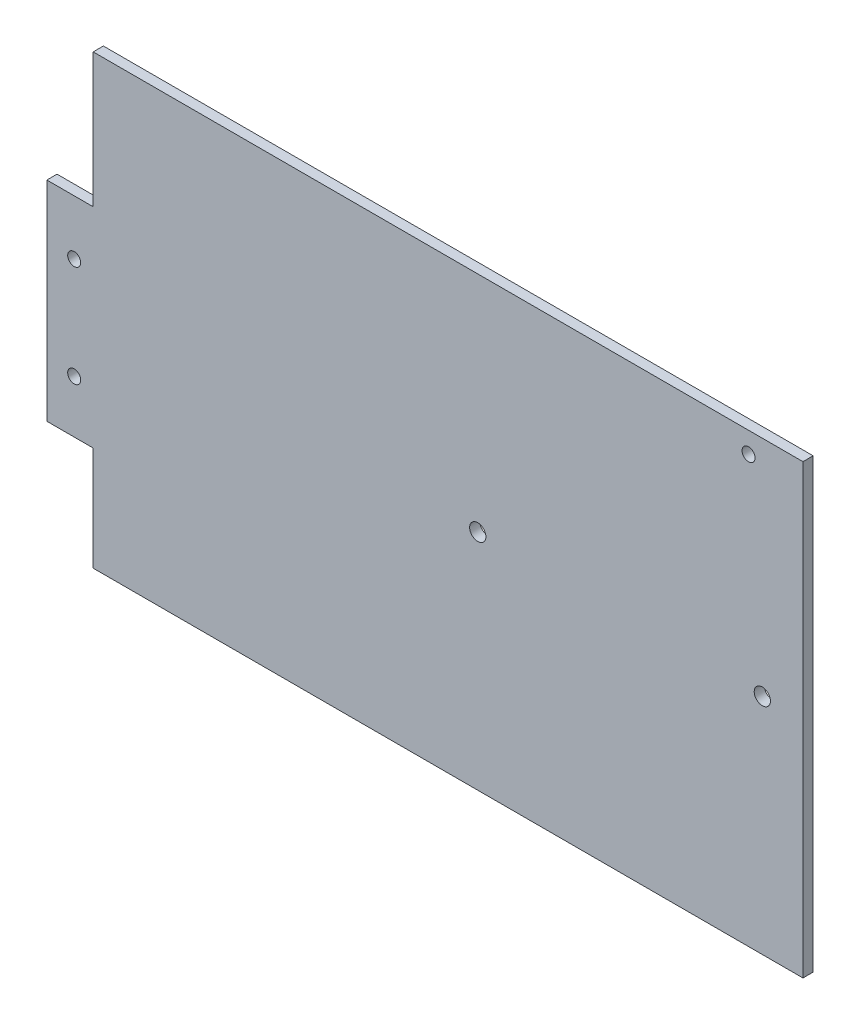
ISO-10303-21;
HEADER;
FILE_DESCRIPTION(('STEP AP214'),'2;1');
FILE_NAME('part.step','',(''),(''),'','','');
FILE_SCHEMA(('AUTOMOTIVE_DESIGN { 1 0 10303 214 1 1 1 1 }'));
ENDSEC;
DATA;
#1=APPLICATION_CONTEXT('core data for automotive mechanical design processes');
#2=APPLICATION_PROTOCOL_DEFINITION('international standard','automotive_design',2000,#1);
#3=PRODUCT_CONTEXT('',#1,'mechanical');
#4=PRODUCT('Part','Part','',(#3));
#5=PRODUCT_RELATED_PRODUCT_CATEGORY('part','',(#4));
#6=PRODUCT_DEFINITION_FORMATION('','',#4);
#7=PRODUCT_DEFINITION_CONTEXT('part definition',#1,'design');
#8=PRODUCT_DEFINITION('design','',#6,#7);
#9=PRODUCT_DEFINITION_SHAPE('','',#8);
#10=(LENGTH_UNIT() NAMED_UNIT(*) SI_UNIT(.MILLI.,.METRE.));
#11=(NAMED_UNIT(*) PLANE_ANGLE_UNIT() SI_UNIT($,.RADIAN.));
#12=(NAMED_UNIT(*) SI_UNIT($,.STERADIAN.) SOLID_ANGLE_UNIT());
#13=UNCERTAINTY_MEASURE_WITH_UNIT(LENGTH_MEASURE(1.E-05),#10,'distance_accuracy_value','');
#14=(GEOMETRIC_REPRESENTATION_CONTEXT(3) GLOBAL_UNCERTAINTY_ASSIGNED_CONTEXT((#13)) GLOBAL_UNIT_ASSIGNED_CONTEXT((#10,
#11,#12)) REPRESENTATION_CONTEXT('',''));
#15=CARTESIAN_POINT('',(0.,0.,0.));
#16=DIRECTION('',(0.,0.,1.));
#17=DIRECTION('',(1.,0.,0.));
#18=AXIS2_PLACEMENT_3D('',#15,#16,#17);
#19=CARTESIAN_POINT('',(-221.742,0.,3.175));
#20=DIRECTION('',(-1.,0.,0.));
#21=DIRECTION('',(0.,-1.,0.));
#22=AXIS2_PLACEMENT_3D('',#19,#20,#21);
#23=PLANE('',#22);
#24=DIRECTION('',(0.,1.,0.));
#25=VECTOR('',#24,1.);
#26=CARTESIAN_POINT('',(-221.742,0.,0.));
#27=LINE('',#26,#25);
#28=CARTESIAN_POINT('',(-221.742,0.,0.));
#29=VERTEX_POINT('',#28);
#30=CARTESIAN_POINT('',(-221.742,32.512,0.));
#31=VERTEX_POINT('',#30);
#32=EDGE_CURVE('E139',#29,#31,#27,.T.);
#33=ORIENTED_EDGE('',*,*,#32,.F.);
#34=DIRECTION('',(0.,0.,-1.));
#35=VECTOR('',#34,1.);
#36=CARTESIAN_POINT('',(-221.742,0.,3.175));
#37=LINE('',#36,#35);
#38=CARTESIAN_POINT('',(-221.742,0.,3.175));
#39=VERTEX_POINT('',#38);
#40=EDGE_CURVE('E11',#39,#29,#37,.T.);
#41=ORIENTED_EDGE('',*,*,#40,.F.);
#42=DIRECTION('',(0.,1.,0.));
#43=VECTOR('',#42,1.);
#44=CARTESIAN_POINT('',(-221.742,0.,3.175));
#45=LINE('',#44,#43);
#46=CARTESIAN_POINT('',(-221.742,32.512,3.175));
#47=VERTEX_POINT('',#46);
#48=EDGE_CURVE('E164',#39,#47,#45,.T.);
#49=ORIENTED_EDGE('',*,*,#48,.T.);
#50=DIRECTION('',(0.,0.,-1.));
#51=VECTOR('',#50,1.);
#52=CARTESIAN_POINT('',(-221.742,32.512,3.175));
#53=LINE('',#52,#51);
#54=EDGE_CURVE('E59',#47,#31,#53,.T.);
#55=ORIENTED_EDGE('',*,*,#54,.T.);
#56=EDGE_LOOP('',(#33,#41,#49,#55));
#57=FACE_BOUND('',#56,.T.);
#58=ADVANCED_FACE('F41',(#57),#23,.T.);
#59=CARTESIAN_POINT('',(0.,0.,3.175));
#60=DIRECTION('',(0.,-1.,0.));
#61=DIRECTION('',(1.,0.,0.));
#62=AXIS2_PLACEMENT_3D('',#59,#60,#61);
#63=PLANE('',#62);
#64=DIRECTION('',(-1.,0.,0.));
#65=VECTOR('',#64,1.);
#66=CARTESIAN_POINT('',(0.,0.,0.));
#67=LINE('',#66,#65);
#68=CARTESIAN_POINT('',(0.,0.,0.));
#69=VERTEX_POINT('',#68);
#70=EDGE_CURVE('E142',#69,#29,#67,.T.);
#71=ORIENTED_EDGE('',*,*,#70,.F.);
#72=DIRECTION('',(0.,0.,-1.));
#73=VECTOR('',#72,1.);
#74=CARTESIAN_POINT('',(0.,0.,3.175));
#75=LINE('',#74,#73);
#76=CARTESIAN_POINT('',(0.,0.,3.175));
#77=VERTEX_POINT('',#76);
#78=EDGE_CURVE('E51',#77,#69,#75,.T.);
#79=ORIENTED_EDGE('',*,*,#78,.F.);
#80=DIRECTION('',(-1.,0.,0.));
#81=VECTOR('',#80,1.);
#82=CARTESIAN_POINT('',(0.,0.,3.175));
#83=LINE('',#82,#81);
#84=EDGE_CURVE('E192',#77,#39,#83,.T.);
#85=ORIENTED_EDGE('',*,*,#84,.T.);
#86=ORIENTED_EDGE('',*,*,#40,.T.);
#87=EDGE_LOOP('',(#71,#79,#85,#86));
#88=FACE_BOUND('',#87,.T.);
#89=ADVANCED_FACE('F43',(#88),#63,.T.);
#90=CARTESIAN_POINT('',(0.,0.,3.175));
#91=DIRECTION('',(-1.,0.,0.));
#92=DIRECTION('',(0.,0.,1.));
#93=AXIS2_PLACEMENT_3D('',#90,#91,#92);
#94=PLANE('',#93);
#95=DIRECTION('',(0.,1.,0.));
#96=VECTOR('',#95,1.);
#97=CARTESIAN_POINT('',(0.,0.,0.));
#98=LINE('',#97,#96);
#99=CARTESIAN_POINT('',(0.,139.7,0.));
#100=VERTEX_POINT('',#99);
#101=EDGE_CURVE('E148',#69,#100,#98,.T.);
#102=ORIENTED_EDGE('',*,*,#101,.T.);
#103=DIRECTION('',(0.,0.,-1.));
#104=VECTOR('',#103,1.);
#105=CARTESIAN_POINT('',(0.,139.7,3.175));
#106=LINE('',#105,#104);
#107=CARTESIAN_POINT('',(0.,139.7,3.175));
#108=VERTEX_POINT('',#107);
#109=EDGE_CURVE('E174',#108,#100,#106,.T.);
#110=ORIENTED_EDGE('',*,*,#109,.F.);
#111=DIRECTION('',(0.,1.,0.));
#112=VECTOR('',#111,1.);
#113=CARTESIAN_POINT('',(0.,0.,3.175));
#114=LINE('',#113,#112);
#115=EDGE_CURVE('E183',#77,#108,#114,.T.);
#116=ORIENTED_EDGE('',*,*,#115,.F.);
#117=ORIENTED_EDGE('',*,*,#78,.T.);
#118=EDGE_LOOP('',(#102,#110,#116,#117));
#119=FACE_BOUND('',#118,.T.);
#120=ADVANCED_FACE('F181',(#119),#94,.F.);
#121=CARTESIAN_POINT('',(0.,139.7,3.175));
#122=DIRECTION('',(0.,-1.,0.));
#123=DIRECTION('',(1.,0.,0.));
#124=AXIS2_PLACEMENT_3D('',#121,#122,#123);
#125=PLANE('',#124);
#126=DIRECTION('',(-1.,0.,0.));
#127=VECTOR('',#126,1.);
#128=CARTESIAN_POINT('',(0.,139.7,0.));
#129=LINE('',#128,#127);
#130=CARTESIAN_POINT('',(-221.742,139.7,0.));
#131=VERTEX_POINT('',#130);
#132=EDGE_CURVE('E151',#100,#131,#129,.T.);
#133=ORIENTED_EDGE('',*,*,#132,.T.);
#134=DIRECTION('',(0.,0.,-1.));
#135=VECTOR('',#134,1.);
#136=CARTESIAN_POINT('',(-221.742,139.7,3.175));
#137=LINE('',#136,#135);
#138=CARTESIAN_POINT('',(-221.742,139.7,3.175));
#139=VERTEX_POINT('',#138);
#140=EDGE_CURVE('E171',#139,#131,#137,.T.);
#141=ORIENTED_EDGE('',*,*,#140,.F.);
#142=DIRECTION('',(-1.,0.,0.));
#143=VECTOR('',#142,1.);
#144=CARTESIAN_POINT('',(0.,139.7,3.175));
#145=LINE('',#144,#143);
#146=EDGE_CURVE('E270',#108,#139,#145,.T.);
#147=ORIENTED_EDGE('',*,*,#146,.F.);
#148=ORIENTED_EDGE('',*,*,#109,.T.);
#149=EDGE_LOOP('',(#133,#141,#147,#148));
#150=FACE_BOUND('',#149,.T.);
#151=ADVANCED_FACE('F213',(#150),#125,.F.);
#152=CARTESIAN_POINT('',(-221.742,97.79,0.));
#153=VERTEX_POINT('',#152);
#154=EDGE_CURVE('E144',#153,#131,#27,.T.);
#155=ORIENTED_EDGE('',*,*,#154,.F.);
#156=DIRECTION('',(0.,0.,-1.));
#157=VECTOR('',#156,1.);
#158=CARTESIAN_POINT('',(-221.742,97.79,3.175));
#159=LINE('',#158,#157);
#160=CARTESIAN_POINT('',(-221.742,97.79,3.175));
#161=VERTEX_POINT('',#160);
#162=EDGE_CURVE('E129',#161,#153,#159,.T.);
#163=ORIENTED_EDGE('',*,*,#162,.F.);
#164=EDGE_CURVE('E117',#161,#139,#45,.T.);
#165=ORIENTED_EDGE('',*,*,#164,.T.);
#166=ORIENTED_EDGE('',*,*,#140,.T.);
#167=EDGE_LOOP('',(#155,#163,#165,#166));
#168=FACE_BOUND('',#167,.T.);
#169=ADVANCED_FACE('F206',(#168),#23,.T.);
#170=CARTESIAN_POINT('',(0.,97.79,3.175));
#171=DIRECTION('',(0.,-1.,0.));
#172=DIRECTION('',(0.,0.,-1.));
#173=AXIS2_PLACEMENT_3D('',#170,#171,#172);
#174=PLANE('',#173);
#175=DIRECTION('',(-1.,0.,0.));
#176=VECTOR('',#175,1.);
#177=CARTESIAN_POINT('',(0.,97.79,0.));
#178=LINE('',#177,#176);
#179=CARTESIAN_POINT('',(-236.22,97.79,0.));
#180=VERTEX_POINT('',#179);
#181=EDGE_CURVE('E125',#153,#180,#178,.T.);
#182=ORIENTED_EDGE('',*,*,#181,.T.);
#183=DIRECTION('',(0.,0.,-1.));
#184=VECTOR('',#183,1.);
#185=CARTESIAN_POINT('',(-236.22,97.79,3.175));
#186=LINE('',#185,#184);
#187=CARTESIAN_POINT('',(-236.22,97.79,3.175));
#188=VERTEX_POINT('',#187);
#189=EDGE_CURVE('E122',#188,#180,#186,.T.);
#190=ORIENTED_EDGE('',*,*,#189,.F.);
#191=DIRECTION('',(-1.,0.,0.));
#192=VECTOR('',#191,1.);
#193=CARTESIAN_POINT('',(0.,97.79,3.175));
#194=LINE('',#193,#192);
#195=EDGE_CURVE('E110',#161,#188,#194,.T.);
#196=ORIENTED_EDGE('',*,*,#195,.F.);
#197=ORIENTED_EDGE('',*,*,#162,.T.);
#198=EDGE_LOOP('',(#182,#190,#196,#197));
#199=FACE_BOUND('',#198,.T.);
#200=ADVANCED_FACE('F123',(#199),#174,.F.);
#201=CARTESIAN_POINT('',(-236.22,0.,3.175));
#202=DIRECTION('',(1.,0.,0.));
#203=DIRECTION('',(0.,0.,-1.));
#204=AXIS2_PLACEMENT_3D('',#201,#202,#203);
#205=PLANE('',#204);
#206=DIRECTION('',(0.,-1.,0.));
#207=VECTOR('',#206,1.);
#208=CARTESIAN_POINT('',(-236.22,0.,0.));
#209=LINE('',#208,#207);
#210=CARTESIAN_POINT('',(-236.22,32.512,0.));
#211=VERTEX_POINT('',#210);
#212=EDGE_CURVE('E157',#180,#211,#209,.T.);
#213=ORIENTED_EDGE('',*,*,#212,.T.);
#214=DIRECTION('',(0.,0.,-1.));
#215=VECTOR('',#214,1.);
#216=CARTESIAN_POINT('',(-236.22,32.512,3.175));
#217=LINE('',#216,#215);
#218=CARTESIAN_POINT('',(-236.22,32.512,3.175));
#219=VERTEX_POINT('',#218);
#220=EDGE_CURVE('E85',#219,#211,#217,.T.);
#221=ORIENTED_EDGE('',*,*,#220,.F.);
#222=DIRECTION('',(0.,-1.,0.));
#223=VECTOR('',#222,1.);
#224=CARTESIAN_POINT('',(-236.22,0.,3.175));
#225=LINE('',#224,#223);
#226=EDGE_CURVE('E115',#188,#219,#225,.T.);
#227=ORIENTED_EDGE('',*,*,#226,.F.);
#228=ORIENTED_EDGE('',*,*,#189,.T.);
#229=EDGE_LOOP('',(#213,#221,#227,#228));
#230=FACE_BOUND('',#229,.T.);
#231=ADVANCED_FACE('F131',(#230),#205,.F.);
#232=CARTESIAN_POINT('',(0.,32.512,3.175));
#233=DIRECTION('',(0.,-1.,0.));
#234=DIRECTION('',(0.,0.,-1.));
#235=AXIS2_PLACEMENT_3D('',#232,#233,#234);
#236=PLANE('',#235);
#237=DIRECTION('',(-1.,0.,0.));
#238=VECTOR('',#237,1.);
#239=CARTESIAN_POINT('',(0.,32.512,0.));
#240=LINE('',#239,#238);
#241=EDGE_CURVE('E160',#31,#211,#240,.T.);
#242=ORIENTED_EDGE('',*,*,#241,.F.);
#243=ORIENTED_EDGE('',*,*,#54,.F.);
#244=DIRECTION('',(-1.,0.,0.));
#245=VECTOR('',#244,1.);
#246=CARTESIAN_POINT('',(0.,32.512,3.175));
#247=LINE('',#246,#245);
#248=EDGE_CURVE('E133',#47,#219,#247,.T.);
#249=ORIENTED_EDGE('',*,*,#248,.T.);
#250=ORIENTED_EDGE('',*,*,#220,.T.);
#251=EDGE_LOOP('',(#242,#243,#249,#250));
#252=FACE_BOUND('',#251,.T.);
#253=ADVANCED_FACE('F193',(#252),#236,.T.);
#254=CARTESIAN_POINT('',(0.,0.,3.175));
#255=DIRECTION('',(0.,0.,1.));
#256=DIRECTION('',(1.,0.,0.));
#257=AXIS2_PLACEMENT_3D('',#254,#255,#256);
#258=PLANE('',#257);
#259=CARTESIAN_POINT('',(-101.6,69.85,3.175));
#260=DIRECTION('',(0.,0.,1.));
#261=DIRECTION('',(1.,0.,0.));
#262=AXIS2_PLACEMENT_3D('',#259,#260,#261);
#263=CIRCLE('',#262,2.53999999999999);
#264=CARTESIAN_POINT('',(-99.06,69.85,3.175));
#265=VERTEX_POINT('',#264);
#266=EDGE_CURVE('E250',#265,#265,#263,.T.);
#267=ORIENTED_EDGE('',*,*,#266,.F.);
#268=EDGE_LOOP('',(#267));
#269=FACE_BOUND('',#268,.T.);
#270=CARTESIAN_POINT('',(-12.7,69.85,3.175));
#271=DIRECTION('',(0.,0.,1.));
#272=DIRECTION('',(1.,0.,0.));
#273=AXIS2_PLACEMENT_3D('',#270,#271,#272);
#274=CIRCLE('',#273,2.54);
#275=CARTESIAN_POINT('',(-10.16,69.85,3.175));
#276=VERTEX_POINT('',#275);
#277=EDGE_CURVE('E258',#276,#276,#274,.T.);
#278=ORIENTED_EDGE('',*,*,#277,.F.);
#279=EDGE_LOOP('',(#278));
#280=FACE_BOUND('',#279,.T.);
#281=CARTESIAN_POINT('',(-17.,133.2,3.175));
#282=DIRECTION('',(0.,0.,1.));
#283=DIRECTION('',(1.,0.,0.));
#284=AXIS2_PLACEMENT_3D('',#281,#282,#283);
#285=CIRCLE('',#284,2.03199999999999);
#286=CARTESIAN_POINT('',(-14.968,133.2,3.175));
#287=VERTEX_POINT('',#286);
#288=EDGE_CURVE('E242',#287,#287,#285,.T.);
#289=ORIENTED_EDGE('',*,*,#288,.F.);
#290=EDGE_LOOP('',(#289));
#291=FACE_BOUND('',#290,.T.);
#292=CARTESIAN_POINT('',(-227.680130405457,80.6813315830843,3.175));
#293=DIRECTION('',(0.,0.,-1.));
#294=DIRECTION('',(-1.,0.,0.));
#295=AXIS2_PLACEMENT_3D('',#292,#293,#294);
#296=CIRCLE('',#295,2.03200000000001);
#297=CARTESIAN_POINT('',(-229.712130405457,80.6813315830843,3.175));
#298=VERTEX_POINT('',#297);
#299=EDGE_CURVE('E143',#298,#298,#296,.T.);
#300=ORIENTED_EDGE('',*,*,#299,.T.);
#301=EDGE_LOOP('',(#300));
#302=FACE_BOUND('',#301,.T.);
#303=CARTESIAN_POINT('',(-227.680130405457,48.9313315830843,3.175));
#304=DIRECTION('',(0.,0.,-1.));
#305=DIRECTION('',(-1.,0.,0.));
#306=AXIS2_PLACEMENT_3D('',#303,#304,#305);
#307=CIRCLE('',#306,2.03200000000001);
#308=CARTESIAN_POINT('',(-229.712130405457,48.9313315830843,3.175));
#309=VERTEX_POINT('',#308);
#310=EDGE_CURVE('E230',#309,#309,#307,.T.);
#311=ORIENTED_EDGE('',*,*,#310,.T.);
#312=EDGE_LOOP('',(#311));
#313=FACE_BOUND('',#312,.T.);
#314=ORIENTED_EDGE('',*,*,#48,.F.);
#315=ORIENTED_EDGE('',*,*,#84,.F.);
#316=ORIENTED_EDGE('',*,*,#115,.T.);
#317=ORIENTED_EDGE('',*,*,#146,.T.);
#318=ORIENTED_EDGE('',*,*,#164,.F.);
#319=ORIENTED_EDGE('',*,*,#195,.T.);
#320=ORIENTED_EDGE('',*,*,#226,.T.);
#321=ORIENTED_EDGE('',*,*,#248,.F.);
#322=EDGE_LOOP('',(#314,#315,#316,#317,#318,#319,#320,#321));
#323=FACE_BOUND('',#322,.T.);
#324=ADVANCED_FACE('F112',(#269,#280,#291,#302,#313,#323),#258,.T.);
#325=CARTESIAN_POINT('',(0.,0.,0.));
#326=DIRECTION('',(0.,0.,1.));
#327=DIRECTION('',(1.,0.,0.));
#328=AXIS2_PLACEMENT_3D('',#325,#326,#327);
#329=PLANE('',#328);
#330=CARTESIAN_POINT('',(-101.6,69.85,0.));
#331=DIRECTION('',(0.,0.,1.));
#332=DIRECTION('',(1.,0.,0.));
#333=AXIS2_PLACEMENT_3D('',#330,#331,#332);
#334=CIRCLE('',#333,2.53999999999999);
#335=CARTESIAN_POINT('',(-99.06,69.85,0.));
#336=VERTEX_POINT('',#335);
#337=EDGE_CURVE('E246',#336,#336,#334,.T.);
#338=ORIENTED_EDGE('',*,*,#337,.T.);
#339=EDGE_LOOP('',(#338));
#340=FACE_BOUND('',#339,.T.);
#341=CARTESIAN_POINT('',(-12.7,69.85,0.));
#342=DIRECTION('',(0.,0.,1.));
#343=DIRECTION('',(1.,0.,0.));
#344=AXIS2_PLACEMENT_3D('',#341,#342,#343);
#345=CIRCLE('',#344,2.54);
#346=CARTESIAN_POINT('',(-10.16,69.85,0.));
#347=VERTEX_POINT('',#346);
#348=EDGE_CURVE('E254',#347,#347,#345,.T.);
#349=ORIENTED_EDGE('',*,*,#348,.T.);
#350=EDGE_LOOP('',(#349));
#351=FACE_BOUND('',#350,.T.);
#352=CARTESIAN_POINT('',(-17.,133.2,0.));
#353=DIRECTION('',(0.,0.,1.));
#354=DIRECTION('',(1.,0.,0.));
#355=AXIS2_PLACEMENT_3D('',#352,#353,#354);
#356=CIRCLE('',#355,2.03199999999999);
#357=CARTESIAN_POINT('',(-14.968,133.2,0.));
#358=VERTEX_POINT('',#357);
#359=EDGE_CURVE('E238',#358,#358,#356,.T.);
#360=ORIENTED_EDGE('',*,*,#359,.T.);
#361=EDGE_LOOP('',(#360));
#362=FACE_BOUND('',#361,.T.);
#363=CARTESIAN_POINT('',(-227.680130405457,80.6813315830843,0.));
#364=DIRECTION('',(0.,0.,-1.));
#365=DIRECTION('',(-1.,0.,0.));
#366=AXIS2_PLACEMENT_3D('',#363,#364,#365);
#367=CIRCLE('',#366,2.03200000000001);
#368=CARTESIAN_POINT('',(-229.712130405457,80.6813315830843,0.));
#369=VERTEX_POINT('',#368);
#370=EDGE_CURVE('E226',#369,#369,#367,.T.);
#371=ORIENTED_EDGE('',*,*,#370,.F.);
#372=EDGE_LOOP('',(#371));
#373=FACE_BOUND('',#372,.T.);
#374=CARTESIAN_POINT('',(-227.680130405457,48.9313315830843,0.));
#375=DIRECTION('',(0.,0.,-1.));
#376=DIRECTION('',(-1.,0.,0.));
#377=AXIS2_PLACEMENT_3D('',#374,#375,#376);
#378=CIRCLE('',#377,2.03200000000001);
#379=CARTESIAN_POINT('',(-229.712130405457,48.9313315830843,0.));
#380=VERTEX_POINT('',#379);
#381=EDGE_CURVE('E234',#380,#380,#378,.T.);
#382=ORIENTED_EDGE('',*,*,#381,.F.);
#383=EDGE_LOOP('',(#382));
#384=FACE_BOUND('',#383,.T.);
#385=ORIENTED_EDGE('',*,*,#32,.T.);
#386=ORIENTED_EDGE('',*,*,#241,.T.);
#387=ORIENTED_EDGE('',*,*,#212,.F.);
#388=ORIENTED_EDGE('',*,*,#181,.F.);
#389=ORIENTED_EDGE('',*,*,#154,.T.);
#390=ORIENTED_EDGE('',*,*,#132,.F.);
#391=ORIENTED_EDGE('',*,*,#101,.F.);
#392=ORIENTED_EDGE('',*,*,#70,.T.);
#393=EDGE_LOOP('',(#385,#386,#387,#388,#389,#390,#391,#392));
#394=FACE_BOUND('',#393,.T.);
#395=ADVANCED_FACE('F190',(#340,#351,#362,#373,#384,#394),#329,.F.);
#396=CARTESIAN_POINT('',(-227.680130405457,48.9313315830843,3.175));
#397=DIRECTION('',(0.,0.,-1.));
#398=DIRECTION('',(-1.,0.,0.));
#399=AXIS2_PLACEMENT_3D('',#396,#397,#398);
#400=CYLINDRICAL_SURFACE('',#399,2.03200000000001);
#401=ORIENTED_EDGE('',*,*,#310,.F.);
#402=EDGE_LOOP('',(#401));
#403=FACE_BOUND('',#402,.T.);
#404=ORIENTED_EDGE('',*,*,#381,.T.);
#405=EDGE_LOOP('',(#404));
#406=FACE_BOUND('',#405,.T.);
#407=ADVANCED_FACE('F283',(#403,#406),#400,.F.);
#408=CARTESIAN_POINT('',(-227.680130405457,80.6813315830843,3.175));
#409=DIRECTION('',(0.,0.,-1.));
#410=DIRECTION('',(-1.,0.,0.));
#411=AXIS2_PLACEMENT_3D('',#408,#409,#410);
#412=CYLINDRICAL_SURFACE('',#411,2.03200000000001);
#413=ORIENTED_EDGE('',*,*,#299,.F.);
#414=EDGE_LOOP('',(#413));
#415=FACE_BOUND('',#414,.T.);
#416=ORIENTED_EDGE('',*,*,#370,.T.);
#417=EDGE_LOOP('',(#416));
#418=FACE_BOUND('',#417,.T.);
#419=ADVANCED_FACE('F286',(#415,#418),#412,.F.);
#420=CARTESIAN_POINT('',(-17.,133.2,0.));
#421=DIRECTION('',(0.,0.,1.));
#422=DIRECTION('',(1.,0.,0.));
#423=AXIS2_PLACEMENT_3D('',#420,#421,#422);
#424=CYLINDRICAL_SURFACE('',#423,2.03199999999999);
#425=ORIENTED_EDGE('',*,*,#359,.F.);
#426=EDGE_LOOP('',(#425));
#427=FACE_BOUND('',#426,.T.);
#428=ORIENTED_EDGE('',*,*,#288,.T.);
#429=EDGE_LOOP('',(#428));
#430=FACE_BOUND('',#429,.T.);
#431=ADVANCED_FACE('F298',(#427,#430),#424,.F.);
#432=CARTESIAN_POINT('',(-12.7,69.85,0.));
#433=DIRECTION('',(0.,0.,1.));
#434=DIRECTION('',(1.,0.,0.));
#435=AXIS2_PLACEMENT_3D('',#432,#433,#434);
#436=CYLINDRICAL_SURFACE('',#435,2.54);
#437=ORIENTED_EDGE('',*,*,#348,.F.);
#438=EDGE_LOOP('',(#437));
#439=FACE_BOUND('',#438,.T.);
#440=ORIENTED_EDGE('',*,*,#277,.T.);
#441=EDGE_LOOP('',(#440));
#442=FACE_BOUND('',#441,.T.);
#443=ADVANCED_FACE('F274',(#439,#442),#436,.F.);
#444=CARTESIAN_POINT('',(-101.6,69.85,0.));
#445=DIRECTION('',(0.,0.,1.));
#446=DIRECTION('',(1.,0.,0.));
#447=AXIS2_PLACEMENT_3D('',#444,#445,#446);
#448=CYLINDRICAL_SURFACE('',#447,2.53999999999999);
#449=ORIENTED_EDGE('',*,*,#337,.F.);
#450=EDGE_LOOP('',(#449));
#451=FACE_BOUND('',#450,.T.);
#452=ORIENTED_EDGE('',*,*,#266,.T.);
#453=EDGE_LOOP('',(#452));
#454=FACE_BOUND('',#453,.T.);
#455=ADVANCED_FACE('F305',(#451,#454),#448,.F.);
#456=CLOSED_SHELL('',(#58,#89,#120,#151,#169,#200,#231,#253,#324,#395,#407,#419,#431,#443,#455));
#457=MANIFOLD_SOLID_BREP('B2',#456);
#458=ADVANCED_BREP_SHAPE_REPRESENTATION('',(#18,#457),#14);
#459=SHAPE_DEFINITION_REPRESENTATION(#9,#458);
ENDSEC;
END-ISO-10303-21;
